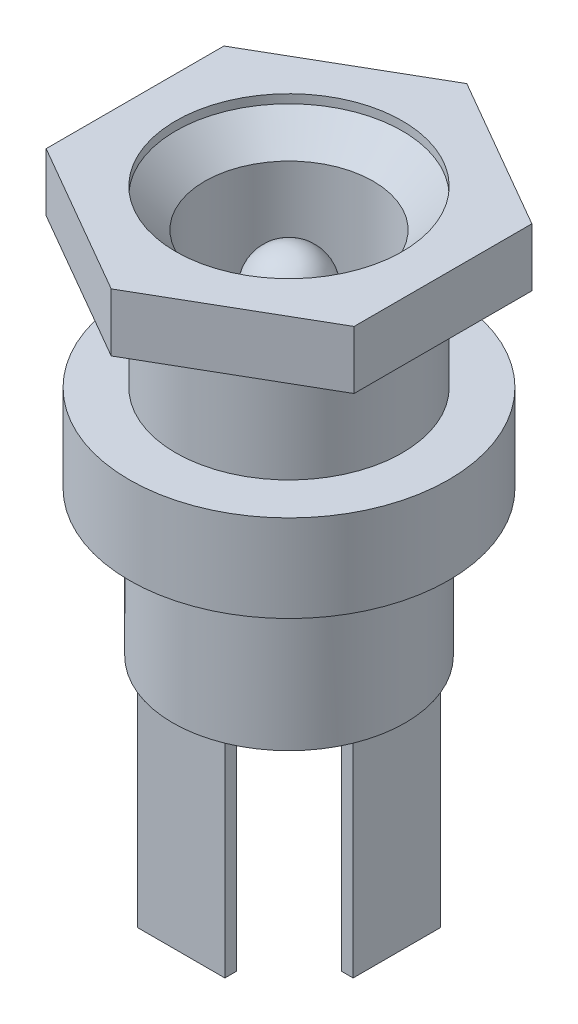
ISO-10303-21;
HEADER;
FILE_DESCRIPTION(('STEP AP214'),'2;1');
FILE_NAME('part.step','',(''),(''),'','','');
FILE_SCHEMA(('AUTOMOTIVE_DESIGN { 1 0 10303 214 1 1 1 1 }'));
ENDSEC;
DATA;
#1=APPLICATION_CONTEXT('core data for automotive mechanical design processes');
#2=APPLICATION_PROTOCOL_DEFINITION('international standard','automotive_design',2000,#1);
#3=PRODUCT_CONTEXT('',#1,'mechanical');
#4=PRODUCT('Part','Part','',(#3));
#5=PRODUCT_RELATED_PRODUCT_CATEGORY('part','',(#4));
#6=PRODUCT_DEFINITION_FORMATION('','',#4);
#7=PRODUCT_DEFINITION_CONTEXT('part definition',#1,'design');
#8=PRODUCT_DEFINITION('design','',#6,#7);
#9=PRODUCT_DEFINITION_SHAPE('','',#8);
#10=(LENGTH_UNIT() NAMED_UNIT(*) SI_UNIT(.MILLI.,.METRE.));
#11=(NAMED_UNIT(*) PLANE_ANGLE_UNIT() SI_UNIT($,.RADIAN.));
#12=(NAMED_UNIT(*) SI_UNIT($,.STERADIAN.) SOLID_ANGLE_UNIT());
#13=UNCERTAINTY_MEASURE_WITH_UNIT(LENGTH_MEASURE(1.E-05),#10,'distance_accuracy_value','');
#14=(GEOMETRIC_REPRESENTATION_CONTEXT(3) GLOBAL_UNCERTAINTY_ASSIGNED_CONTEXT((#13)) GLOBAL_UNIT_ASSIGNED_CONTEXT((#10,
#11,#12)) REPRESENTATION_CONTEXT('',''));
#15=CARTESIAN_POINT('',(0.,0.,0.));
#16=DIRECTION('',(0.,0.,1.));
#17=DIRECTION('',(1.,0.,0.));
#18=AXIS2_PLACEMENT_3D('',#15,#16,#17);
#19=CARTESIAN_POINT('',(0.,0.,4.));
#20=DIRECTION('',(0.,-1.,0.));
#21=DIRECTION('',(0.,0.,-1.));
#22=AXIS2_PLACEMENT_3D('',#19,#20,#21);
#23=PLANE('',#22);
#24=DIRECTION('',(-1.,0.,0.));
#25=VECTOR('',#24,1.);
#26=CARTESIAN_POINT('',(1.5,0.,-3.30809924354783));
#27=LINE('',#26,#25);
#28=CARTESIAN_POINT('',(1.5,0.,-3.30809924354783));
#29=VERTEX_POINT('',#28);
#30=CARTESIAN_POINT('',(-1.5,0.,-3.30809924354783));
#31=VERTEX_POINT('',#30);
#32=EDGE_CURVE('E482',#29,#31,#27,.T.);
#33=ORIENTED_EDGE('',*,*,#32,.F.);
#34=DIRECTION('',(0.,0.,1.));
#35=VECTOR('',#34,1.);
#36=CARTESIAN_POINT('',(1.5,0.,-3.70809924354783));
#37=LINE('',#36,#35);
#38=CARTESIAN_POINT('',(1.5,0.,-3.70809924354783));
#39=VERTEX_POINT('',#38);
#40=EDGE_CURVE('E193',#39,#29,#37,.T.);
#41=ORIENTED_EDGE('',*,*,#40,.F.);
#42=CARTESIAN_POINT('',(0.,0.,0.));
#43=DIRECTION('',(0.,1.,0.));
#44=DIRECTION('',(0.,0.,1.));
#45=AXIS2_PLACEMENT_3D('',#42,#43,#44);
#46=CIRCLE('',#45,4.);
#47=CARTESIAN_POINT('',(3.70809924354783,0.,-1.50000000000001));
#48=VERTEX_POINT('',#47);
#49=EDGE_CURVE('E448',#48,#39,#46,.T.);
#50=ORIENTED_EDGE('',*,*,#49,.F.);
#51=DIRECTION('',(1.,0.,0.));
#52=VECTOR('',#51,1.);
#53=CARTESIAN_POINT('',(3.70809924354783,0.,-1.50000000000001));
#54=LINE('',#53,#52);
#55=CARTESIAN_POINT('',(3.30809924354783,0.,-1.50000000000001));
#56=VERTEX_POINT('',#55);
#57=EDGE_CURVE('E223',#56,#48,#54,.T.);
#58=ORIENTED_EDGE('',*,*,#57,.F.);
#59=DIRECTION('',(0.,0.,-1.));
#60=VECTOR('',#59,1.);
#61=CARTESIAN_POINT('',(3.30809924354784,0.,1.49999999999999));
#62=LINE('',#61,#60);
#63=CARTESIAN_POINT('',(3.30809924354784,0.,1.49999999999999));
#64=VERTEX_POINT('',#63);
#65=EDGE_CURVE('E201',#64,#56,#62,.T.);
#66=ORIENTED_EDGE('',*,*,#65,.F.);
#67=DIRECTION('',(-1.,0.,0.));
#68=VECTOR('',#67,1.);
#69=CARTESIAN_POINT('',(3.70809924354784,0.,1.49999999999999));
#70=LINE('',#69,#68);
#71=CARTESIAN_POINT('',(3.70809924354784,0.,1.49999999999999));
#72=VERTEX_POINT('',#71);
#73=EDGE_CURVE('E196',#72,#64,#70,.T.);
#74=ORIENTED_EDGE('',*,*,#73,.F.);
#75=CARTESIAN_POINT('',(1.5,0.,3.70809924354783));
#76=VERTEX_POINT('',#75);
#77=EDGE_CURVE('E360',#76,#72,#46,.T.);
#78=ORIENTED_EDGE('',*,*,#77,.F.);
#79=DIRECTION('',(0.,0.,1.));
#80=VECTOR('',#79,1.);
#81=CARTESIAN_POINT('',(1.5,0.,3.70809924354783));
#82=LINE('',#81,#80);
#83=CARTESIAN_POINT('',(1.5,0.,3.30809924354783));
#84=VERTEX_POINT('',#83);
#85=EDGE_CURVE('E263',#84,#76,#82,.T.);
#86=ORIENTED_EDGE('',*,*,#85,.F.);
#87=DIRECTION('',(1.,0.,0.));
#88=VECTOR('',#87,1.);
#89=CARTESIAN_POINT('',(-1.5,0.,3.30809924354783));
#90=LINE('',#89,#88);
#91=CARTESIAN_POINT('',(-1.5,0.,3.30809924354783));
#92=VERTEX_POINT('',#91);
#93=EDGE_CURVE('E259',#92,#84,#90,.T.);
#94=ORIENTED_EDGE('',*,*,#93,.F.);
#95=DIRECTION('',(0.,0.,-1.));
#96=VECTOR('',#95,1.);
#97=CARTESIAN_POINT('',(-1.5,0.,3.70809924354783));
#98=LINE('',#97,#96);
#99=CARTESIAN_POINT('',(-1.5,0.,3.70809924354783));
#100=VERTEX_POINT('',#99);
#101=EDGE_CURVE('E240',#100,#92,#98,.T.);
#102=ORIENTED_EDGE('',*,*,#101,.F.);
#103=CARTESIAN_POINT('',(-1.5,0.,-3.70809924354783));
#104=VERTEX_POINT('',#103);
#105=EDGE_CURVE('E366',#104,#100,#46,.T.);
#106=ORIENTED_EDGE('',*,*,#105,.F.);
#107=DIRECTION('',(0.,0.,-1.));
#108=VECTOR('',#107,1.);
#109=CARTESIAN_POINT('',(-1.5,0.,-3.70809924354783));
#110=LINE('',#109,#108);
#111=EDGE_CURVE('E487',#31,#104,#110,.T.);
#112=ORIENTED_EDGE('',*,*,#111,.F.);
#113=EDGE_LOOP('',(#33,#41,#50,#58,#66,#74,#78,#86,#94,#102,#106,#112));
#114=FACE_BOUND('',#113,.T.);
#115=ADVANCED_FACE('F41',(#114),#23,.T.);
#116=EDGE_CURVE('E477',#39,#104,#46,.T.);
#117=ORIENTED_EDGE('',*,*,#116,.F.);
#118=DIRECTION('',(1.,0.,0.));
#119=VECTOR('',#118,1.);
#120=CARTESIAN_POINT('',(1.5,0.,-3.70809924354783));
#121=LINE('',#120,#119);
#122=EDGE_CURVE('E189',#104,#39,#121,.T.);
#123=ORIENTED_EDGE('',*,*,#122,.F.);
#124=EDGE_LOOP('',(#117,#123));
#125=FACE_BOUND('',#124,.T.);
#126=ADVANCED_FACE('F409',(#125),#23,.T.);
#127=EDGE_CURVE('E365',#72,#48,#46,.T.);
#128=ORIENTED_EDGE('',*,*,#127,.F.);
#129=DIRECTION('',(0.,0.,1.));
#130=VECTOR('',#129,1.);
#131=CARTESIAN_POINT('',(3.70809924354784,0.,1.49999999999999));
#132=LINE('',#131,#130);
#133=EDGE_CURVE('E211',#48,#72,#132,.T.);
#134=ORIENTED_EDGE('',*,*,#133,.F.);
#135=EDGE_LOOP('',(#128,#134));
#136=FACE_BOUND('',#135,.T.);
#137=ADVANCED_FACE('F416',(#136),#23,.T.);
#138=CARTESIAN_POINT('',(0.,12.2,0.));
#139=DIRECTION('',(0.,1.,0.));
#140=DIRECTION('',(0.,0.,1.));
#141=AXIS2_PLACEMENT_3D('',#138,#139,#140);
#142=CYLINDRICAL_SURFACE('',#141,3.9);
#143=CARTESIAN_POINT('',(0.,8.,0.));
#144=DIRECTION('',(0.,1.,0.));
#145=DIRECTION('',(0.,0.,1.));
#146=AXIS2_PLACEMENT_3D('',#143,#144,#145);
#147=CIRCLE('',#146,3.9);
#148=CARTESIAN_POINT('',(0.,8.,3.9));
#149=VERTEX_POINT('',#148);
#150=EDGE_CURVE('E378',#149,#149,#147,.T.);
#151=ORIENTED_EDGE('',*,*,#150,.T.);
#152=EDGE_LOOP('',(#151));
#153=FACE_BOUND('',#152,.T.);
#154=CARTESIAN_POINT('',(0.,12.,0.));
#155=DIRECTION('',(0.,1.,0.));
#156=DIRECTION('',(0.,0.,1.));
#157=AXIS2_PLACEMENT_3D('',#154,#155,#156);
#158=CIRCLE('',#157,3.9);
#159=CARTESIAN_POINT('',(0.,12.,3.9));
#160=VERTEX_POINT('',#159);
#161=EDGE_CURVE('E285',#160,#160,#158,.T.);
#162=ORIENTED_EDGE('',*,*,#161,.F.);
#163=EDGE_LOOP('',(#162));
#164=FACE_BOUND('',#163,.T.);
#165=ADVANCED_FACE('F434',(#153,#164),#142,.T.);
#166=CARTESIAN_POINT('',(0.,8.,3.9));
#167=DIRECTION('',(0.,1.,0.));
#168=DIRECTION('',(0.,0.,1.));
#169=AXIS2_PLACEMENT_3D('',#166,#167,#168);
#170=PLANE('',#169);
#171=CARTESIAN_POINT('',(0.,8.,0.));
#172=DIRECTION('',(0.,1.,0.));
#173=DIRECTION('',(0.,0.,1.));
#174=AXIS2_PLACEMENT_3D('',#171,#172,#173);
#175=CIRCLE('',#174,5.5);
#176=CARTESIAN_POINT('',(0.,8.,5.5));
#177=VERTEX_POINT('',#176);
#178=EDGE_CURVE('E374',#177,#177,#175,.T.);
#179=ORIENTED_EDGE('',*,*,#178,.T.);
#180=EDGE_LOOP('',(#179));
#181=FACE_BOUND('',#180,.T.);
#182=ORIENTED_EDGE('',*,*,#150,.F.);
#183=EDGE_LOOP('',(#182));
#184=FACE_BOUND('',#183,.T.);
#185=ADVANCED_FACE('F439',(#181,#184),#170,.T.);
#186=CARTESIAN_POINT('',(0.,12.2,0.));
#187=DIRECTION('',(0.,1.,0.));
#188=DIRECTION('',(0.,0.,1.));
#189=AXIS2_PLACEMENT_3D('',#186,#187,#188);
#190=CYLINDRICAL_SURFACE('',#189,5.5);
#191=CARTESIAN_POINT('',(0.,5.,0.));
#192=DIRECTION('',(0.,1.,0.));
#193=DIRECTION('',(0.,0.,1.));
#194=AXIS2_PLACEMENT_3D('',#191,#192,#193);
#195=CIRCLE('',#194,5.5);
#196=CARTESIAN_POINT('',(0.,5.,5.5));
#197=VERTEX_POINT('',#196);
#198=EDGE_CURVE('E370',#197,#197,#195,.T.);
#199=ORIENTED_EDGE('',*,*,#198,.T.);
#200=EDGE_LOOP('',(#199));
#201=FACE_BOUND('',#200,.T.);
#202=ORIENTED_EDGE('',*,*,#178,.F.);
#203=EDGE_LOOP('',(#202));
#204=FACE_BOUND('',#203,.T.);
#205=ADVANCED_FACE('F664',(#201,#204),#190,.T.);
#206=CARTESIAN_POINT('',(0.,5.,5.5));
#207=DIRECTION('',(0.,-1.,0.));
#208=DIRECTION('',(0.,0.,-1.));
#209=AXIS2_PLACEMENT_3D('',#206,#207,#208);
#210=PLANE('',#209);
#211=CARTESIAN_POINT('',(0.,5.,0.));
#212=DIRECTION('',(0.,1.,0.));
#213=DIRECTION('',(0.,0.,1.));
#214=AXIS2_PLACEMENT_3D('',#211,#212,#213);
#215=CIRCLE('',#214,4.);
#216=CARTESIAN_POINT('',(0.,5.,4.));
#217=VERTEX_POINT('',#216);
#218=EDGE_CURVE('E364',#217,#217,#215,.T.);
#219=ORIENTED_EDGE('',*,*,#218,.T.);
#220=EDGE_LOOP('',(#219));
#221=FACE_BOUND('',#220,.T.);
#222=ORIENTED_EDGE('',*,*,#198,.F.);
#223=EDGE_LOOP('',(#222));
#224=FACE_BOUND('',#223,.T.);
#225=ADVANCED_FACE('F431',(#221,#224),#210,.T.);
#226=CARTESIAN_POINT('',(0.,12.2,0.));
#227=DIRECTION('',(0.,1.,0.));
#228=DIRECTION('',(0.,0.,1.));
#229=AXIS2_PLACEMENT_3D('',#226,#227,#228);
#230=CYLINDRICAL_SURFACE('',#229,4.);
#231=ORIENTED_EDGE('',*,*,#77,.T.);
#232=ORIENTED_EDGE('',*,*,#127,.T.);
#233=ORIENTED_EDGE('',*,*,#49,.T.);
#234=ORIENTED_EDGE('',*,*,#116,.T.);
#235=ORIENTED_EDGE('',*,*,#105,.T.);
#236=EDGE_CURVE('E359',#100,#76,#46,.T.);
#237=ORIENTED_EDGE('',*,*,#236,.T.);
#238=EDGE_LOOP('',(#231,#232,#233,#234,#235,#237));
#239=FACE_BOUND('',#238,.T.);
#240=ORIENTED_EDGE('',*,*,#218,.F.);
#241=EDGE_LOOP('',(#240));
#242=FACE_BOUND('',#241,.T.);
#243=ADVANCED_FACE('F422',(#239,#242),#230,.T.);
#244=DIRECTION('',(-1.,0.,0.));
#245=VECTOR('',#244,1.);
#246=CARTESIAN_POINT('',(-1.5,0.,3.70809924354783));
#247=LINE('',#246,#245);
#248=EDGE_CURVE('E246',#76,#100,#247,.T.);
#249=ORIENTED_EDGE('',*,*,#248,.F.);
#250=ORIENTED_EDGE('',*,*,#236,.F.);
#251=EDGE_LOOP('',(#249,#250));
#252=FACE_BOUND('',#251,.T.);
#253=ADVANCED_FACE('F412',(#252),#23,.T.);
#254=CARTESIAN_POINT('',(0.,14.,0.));
#255=DIRECTION('',(0.,1.,0.));
#256=DIRECTION('',(0.,0.,1.));
#257=AXIS2_PLACEMENT_3D('',#254,#255,#256);
#258=PLANE('',#257);
#259=DIRECTION('',(0.,0.,-1.));
#260=VECTOR('',#259,1.);
#261=CARTESIAN_POINT('',(5.3,14.,3.05995642670502));
#262=LINE('',#261,#260);
#263=CARTESIAN_POINT('',(5.3,14.,3.05995642670502));
#264=VERTEX_POINT('',#263);
#265=CARTESIAN_POINT('',(5.3,14.,-3.05995642670502));
#266=VERTEX_POINT('',#265);
#267=EDGE_CURVE('E294',#264,#266,#262,.T.);
#268=ORIENTED_EDGE('',*,*,#267,.T.);
#269=DIRECTION('',(-0.866025403784439,0.,-0.5));
#270=VECTOR('',#269,1.);
#271=CARTESIAN_POINT('',(5.3,14.,-3.05995642670502));
#272=LINE('',#271,#270);
#273=CARTESIAN_POINT('',(0.,14.,-6.11991285341003));
#274=VERTEX_POINT('',#273);
#275=EDGE_CURVE('E298',#266,#274,#272,.T.);
#276=ORIENTED_EDGE('',*,*,#275,.T.);
#277=DIRECTION('',(-0.866025403784439,0.,0.5));
#278=VECTOR('',#277,1.);
#279=CARTESIAN_POINT('',(0.,14.,-6.11991285341003));
#280=LINE('',#279,#278);
#281=CARTESIAN_POINT('',(-5.3,14.,-3.05995642670502));
#282=VERTEX_POINT('',#281);
#283=EDGE_CURVE('E302',#274,#282,#280,.T.);
#284=ORIENTED_EDGE('',*,*,#283,.T.);
#285=DIRECTION('',(0.,0.,1.));
#286=VECTOR('',#285,1.);
#287=CARTESIAN_POINT('',(-5.3,14.,-3.05995642670502));
#288=LINE('',#287,#286);
#289=CARTESIAN_POINT('',(-5.3,14.,3.05995642670502));
#290=VERTEX_POINT('',#289);
#291=EDGE_CURVE('E305',#282,#290,#288,.T.);
#292=ORIENTED_EDGE('',*,*,#291,.T.);
#293=DIRECTION('',(0.866025403784439,0.,0.5));
#294=VECTOR('',#293,1.);
#295=CARTESIAN_POINT('',(-5.3,14.,3.05995642670502));
#296=LINE('',#295,#294);
#297=CARTESIAN_POINT('',(0.,14.,6.11991285341003));
#298=VERTEX_POINT('',#297);
#299=EDGE_CURVE('E308',#290,#298,#296,.T.);
#300=ORIENTED_EDGE('',*,*,#299,.T.);
#301=DIRECTION('',(0.866025403784439,0.,-0.5));
#302=VECTOR('',#301,1.);
#303=CARTESIAN_POINT('',(0.,14.,6.11991285341003));
#304=LINE('',#303,#302);
#305=EDGE_CURVE('E311',#298,#264,#304,.T.);
#306=ORIENTED_EDGE('',*,*,#305,.T.);
#307=EDGE_LOOP('',(#268,#276,#284,#292,#300,#306));
#308=FACE_BOUND('',#307,.T.);
#309=CARTESIAN_POINT('',(0.,14.,0.));
#310=DIRECTION('',(0.,1.,0.));
#311=DIRECTION('',(0.,0.,1.));
#312=AXIS2_PLACEMENT_3D('',#309,#310,#311);
#313=CIRCLE('',#312,3.9);
#314=CARTESIAN_POINT('',(0.,14.,3.9));
#315=VERTEX_POINT('',#314);
#316=EDGE_CURVE('E286',#315,#315,#313,.T.);
#317=ORIENTED_EDGE('',*,*,#316,.F.);
#318=EDGE_LOOP('',(#317));
#319=FACE_BOUND('',#318,.T.);
#320=ADVANCED_FACE('F421',(#308,#319),#258,.T.);
#321=CARTESIAN_POINT('',(0.,12.,0.));
#322=DIRECTION('',(0.,1.,0.));
#323=DIRECTION('',(0.,0.,1.));
#324=AXIS2_PLACEMENT_3D('',#321,#322,#323);
#325=PLANE('',#324);
#326=DIRECTION('',(0.,0.,-1.));
#327=VECTOR('',#326,1.);
#328=CARTESIAN_POINT('',(5.3,12.,3.05995642670502));
#329=LINE('',#328,#327);
#330=CARTESIAN_POINT('',(5.3,12.,3.05995642670502));
#331=VERTEX_POINT('',#330);
#332=CARTESIAN_POINT('',(5.3,12.,-3.05995642670502));
#333=VERTEX_POINT('',#332);
#334=EDGE_CURVE('E290',#331,#333,#329,.T.);
#335=ORIENTED_EDGE('',*,*,#334,.F.);
#336=DIRECTION('',(0.866025403784439,0.,-0.5));
#337=VECTOR('',#336,1.);
#338=CARTESIAN_POINT('',(0.,12.,6.11991285341003));
#339=LINE('',#338,#337);
#340=CARTESIAN_POINT('',(0.,12.,6.11991285341003));
#341=VERTEX_POINT('',#340);
#342=EDGE_CURVE('E299',#341,#331,#339,.T.);
#343=ORIENTED_EDGE('',*,*,#342,.F.);
#344=DIRECTION('',(0.866025403784439,0.,0.5));
#345=VECTOR('',#344,1.);
#346=CARTESIAN_POINT('',(-5.3,12.,3.05995642670502));
#347=LINE('',#346,#345);
#348=CARTESIAN_POINT('',(-5.3,12.,3.05995642670502));
#349=VERTEX_POINT('',#348);
#350=EDGE_CURVE('E327',#349,#341,#347,.T.);
#351=ORIENTED_EDGE('',*,*,#350,.F.);
#352=DIRECTION('',(0.,0.,1.));
#353=VECTOR('',#352,1.);
#354=CARTESIAN_POINT('',(-5.3,12.,-3.05995642670502));
#355=LINE('',#354,#353);
#356=CARTESIAN_POINT('',(-5.3,12.,-3.05995642670502));
#357=VERTEX_POINT('',#356);
#358=EDGE_CURVE('E324',#357,#349,#355,.T.);
#359=ORIENTED_EDGE('',*,*,#358,.F.);
#360=DIRECTION('',(-0.866025403784439,0.,0.5));
#361=VECTOR('',#360,1.);
#362=CARTESIAN_POINT('',(0.,12.,-6.11991285341003));
#363=LINE('',#362,#361);
#364=CARTESIAN_POINT('',(0.,12.,-6.11991285341003));
#365=VERTEX_POINT('',#364);
#366=EDGE_CURVE('E321',#365,#357,#363,.T.);
#367=ORIENTED_EDGE('',*,*,#366,.F.);
#368=DIRECTION('',(-0.866025403784439,0.,-0.5));
#369=VECTOR('',#368,1.);
#370=CARTESIAN_POINT('',(5.3,12.,-3.05995642670502));
#371=LINE('',#370,#369);
#372=EDGE_CURVE('E318',#333,#365,#371,.T.);
#373=ORIENTED_EDGE('',*,*,#372,.F.);
#374=EDGE_LOOP('',(#335,#343,#351,#359,#367,#373));
#375=FACE_BOUND('',#374,.T.);
#376=ORIENTED_EDGE('',*,*,#161,.T.);
#377=EDGE_LOOP('',(#376));
#378=FACE_BOUND('',#377,.T.);
#379=ADVANCED_FACE('F428',(#375,#378),#325,.F.);
#380=CARTESIAN_POINT('',(5.3,14.,3.05995642670502));
#381=DIRECTION('',(-1.,0.,0.));
#382=DIRECTION('',(0.,0.,1.));
#383=AXIS2_PLACEMENT_3D('',#380,#381,#382);
#384=PLANE('',#383);
#385=ORIENTED_EDGE('',*,*,#334,.T.);
#386=DIRECTION('',(0.,-1.,0.));
#387=VECTOR('',#386,1.);
#388=CARTESIAN_POINT('',(5.3,14.,-3.05995642670502));
#389=LINE('',#388,#387);
#390=EDGE_CURVE('E351',#266,#333,#389,.T.);
#391=ORIENTED_EDGE('',*,*,#390,.F.);
#392=ORIENTED_EDGE('',*,*,#267,.F.);
#393=DIRECTION('',(0.,-1.,0.));
#394=VECTOR('',#393,1.);
#395=CARTESIAN_POINT('',(5.3,14.,3.05995642670502));
#396=LINE('',#395,#394);
#397=EDGE_CURVE('E314',#264,#331,#396,.T.);
#398=ORIENTED_EDGE('',*,*,#397,.T.);
#399=EDGE_LOOP('',(#385,#391,#392,#398));
#400=FACE_BOUND('',#399,.T.);
#401=ADVANCED_FACE('F554',(#400),#384,.F.);
#402=CARTESIAN_POINT('',(5.3,14.,-3.05995642670502));
#403=DIRECTION('',(-0.5,0.,0.866025403784439));
#404=DIRECTION('',(0.866025403784439,0.,0.5));
#405=AXIS2_PLACEMENT_3D('',#402,#403,#404);
#406=PLANE('',#405);
#407=ORIENTED_EDGE('',*,*,#372,.T.);
#408=DIRECTION('',(0.,-1.,0.));
#409=VECTOR('',#408,1.);
#410=CARTESIAN_POINT('',(0.,14.,-6.11991285341003));
#411=LINE('',#410,#409);
#412=EDGE_CURVE('E347',#274,#365,#411,.T.);
#413=ORIENTED_EDGE('',*,*,#412,.F.);
#414=ORIENTED_EDGE('',*,*,#275,.F.);
#415=ORIENTED_EDGE('',*,*,#390,.T.);
#416=EDGE_LOOP('',(#407,#413,#414,#415));
#417=FACE_BOUND('',#416,.T.);
#418=ADVANCED_FACE('F570',(#417),#406,.F.);
#419=CARTESIAN_POINT('',(0.,14.,-6.11991285341003));
#420=DIRECTION('',(0.5,0.,0.866025403784439));
#421=DIRECTION('',(0.866025403784439,0.,-0.5));
#422=AXIS2_PLACEMENT_3D('',#419,#420,#421);
#423=PLANE('',#422);
#424=ORIENTED_EDGE('',*,*,#366,.T.);
#425=DIRECTION('',(0.,-1.,0.));
#426=VECTOR('',#425,1.);
#427=CARTESIAN_POINT('',(-5.3,14.,-3.05995642670502));
#428=LINE('',#427,#426);
#429=EDGE_CURVE('E343',#282,#357,#428,.T.);
#430=ORIENTED_EDGE('',*,*,#429,.F.);
#431=ORIENTED_EDGE('',*,*,#283,.F.);
#432=ORIENTED_EDGE('',*,*,#412,.T.);
#433=EDGE_LOOP('',(#424,#430,#431,#432));
#434=FACE_BOUND('',#433,.T.);
#435=ADVANCED_FACE('F566',(#434),#423,.F.);
#436=CARTESIAN_POINT('',(-5.3,14.,-3.05995642670502));
#437=DIRECTION('',(1.,0.,0.));
#438=DIRECTION('',(0.,0.,-1.));
#439=AXIS2_PLACEMENT_3D('',#436,#437,#438);
#440=PLANE('',#439);
#441=ORIENTED_EDGE('',*,*,#358,.T.);
#442=DIRECTION('',(0.,-1.,0.));
#443=VECTOR('',#442,1.);
#444=CARTESIAN_POINT('',(-5.3,14.,3.05995642670502));
#445=LINE('',#444,#443);
#446=EDGE_CURVE('E339',#290,#349,#445,.T.);
#447=ORIENTED_EDGE('',*,*,#446,.F.);
#448=ORIENTED_EDGE('',*,*,#291,.F.);
#449=ORIENTED_EDGE('',*,*,#429,.T.);
#450=EDGE_LOOP('',(#441,#447,#448,#449));
#451=FACE_BOUND('',#450,.T.);
#452=ADVANCED_FACE('F562',(#451),#440,.F.);
#453=CARTESIAN_POINT('',(-5.3,14.,3.05995642670502));
#454=DIRECTION('',(0.5,0.,-0.866025403784439));
#455=DIRECTION('',(-0.866025403784439,0.,-0.5));
#456=AXIS2_PLACEMENT_3D('',#453,#454,#455);
#457=PLANE('',#456);
#458=ORIENTED_EDGE('',*,*,#350,.T.);
#459=DIRECTION('',(0.,-1.,0.));
#460=VECTOR('',#459,1.);
#461=CARTESIAN_POINT('',(0.,14.,6.11991285341003));
#462=LINE('',#461,#460);
#463=EDGE_CURVE('E335',#298,#341,#462,.T.);
#464=ORIENTED_EDGE('',*,*,#463,.F.);
#465=ORIENTED_EDGE('',*,*,#299,.F.);
#466=ORIENTED_EDGE('',*,*,#446,.T.);
#467=EDGE_LOOP('',(#458,#464,#465,#466));
#468=FACE_BOUND('',#467,.T.);
#469=ADVANCED_FACE('F558',(#468),#457,.F.);
#470=CARTESIAN_POINT('',(0.,14.,6.11991285341003));
#471=DIRECTION('',(-0.5,0.,-0.866025403784439));
#472=DIRECTION('',(-0.866025403784439,0.,0.5));
#473=AXIS2_PLACEMENT_3D('',#470,#471,#472);
#474=PLANE('',#473);
#475=ORIENTED_EDGE('',*,*,#342,.T.);
#476=ORIENTED_EDGE('',*,*,#397,.F.);
#477=ORIENTED_EDGE('',*,*,#305,.F.);
#478=ORIENTED_EDGE('',*,*,#463,.T.);
#479=EDGE_LOOP('',(#475,#476,#477,#478));
#480=FACE_BOUND('',#479,.T.);
#481=ADVANCED_FACE('F549',(#480),#474,.F.);
#482=CARTESIAN_POINT('',(0.,14.,0.));
#483=DIRECTION('',(0.,-1.,0.));
#484=DIRECTION('',(0.,0.,-1.));
#485=AXIS2_PLACEMENT_3D('',#482,#483,#484);
#486=CYLINDRICAL_SURFACE('',#485,3.9);
#487=CARTESIAN_POINT('',(0.,13.7,0.));
#488=DIRECTION('',(0.,1.,0.));
#489=DIRECTION('',(0.,0.,1.));
#490=AXIS2_PLACEMENT_3D('',#487,#488,#489);
#491=CIRCLE('',#490,3.9);
#492=CARTESIAN_POINT('',(0.,13.7,3.9));
#493=VERTEX_POINT('',#492);
#494=EDGE_CURVE('E355',#493,#493,#491,.F.);
#495=ORIENTED_EDGE('',*,*,#494,.T.);
#496=EDGE_LOOP('',(#495));
#497=FACE_BOUND('',#496,.T.);
#498=ORIENTED_EDGE('',*,*,#316,.T.);
#499=EDGE_LOOP('',(#498));
#500=FACE_BOUND('',#499,.T.);
#501=ADVANCED_FACE('F547',(#497,#500),#486,.F.);
#502=CARTESIAN_POINT('',(0.,10.95,0.));
#503=DIRECTION('',(0.,1.,0.));
#504=DIRECTION('',(0.,0.,1.));
#505=AXIS2_PLACEMENT_3D('',#502,#503,#504);
#506=SPHERICAL_SURFACE('',#505,1.25);
#507=CARTESIAN_POINT('',(0.,10.95,0.));
#508=DIRECTION('',(0.,1.,0.));
#509=DIRECTION('',(0.,0.,1.));
#510=AXIS2_PLACEMENT_3D('',#507,#508,#509);
#511=CIRCLE('',#510,1.25);
#512=CARTESIAN_POINT('',(0.,10.95,1.25));
#513=VERTEX_POINT('',#512);
#514=EDGE_CURVE('E11',#513,#513,#511,.T.);
#515=ORIENTED_EDGE('',*,*,#514,.T.);
#516=EDGE_LOOP('',(#515));
#517=FACE_BOUND('',#516,.T.);
#518=ADVANCED_FACE('F43',(#517),#506,.T.);
#519=CARTESIAN_POINT('',(0.,12.2,0.));
#520=DIRECTION('',(0.,1.,0.));
#521=DIRECTION('',(0.,0.,1.));
#522=AXIS2_PLACEMENT_3D('',#519,#520,#521);
#523=CYLINDRICAL_SURFACE('',#522,1.25);
#524=CARTESIAN_POINT('',(0.,6.70000000000001,0.));
#525=DIRECTION('',(0.,1.,0.));
#526=DIRECTION('',(0.,0.,1.));
#527=AXIS2_PLACEMENT_3D('',#524,#525,#526);
#528=CIRCLE('',#527,1.25);
#529=CARTESIAN_POINT('',(0.,6.70000000000001,1.25));
#530=VERTEX_POINT('',#529);
#531=EDGE_CURVE('E50',#530,#530,#528,.T.);
#532=ORIENTED_EDGE('',*,*,#531,.T.);
#533=EDGE_LOOP('',(#532));
#534=FACE_BOUND('',#533,.T.);
#535=ORIENTED_EDGE('',*,*,#514,.F.);
#536=EDGE_LOOP('',(#535));
#537=FACE_BOUND('',#536,.T.);
#538=ADVANCED_FACE('F393',(#534,#537),#523,.T.);
#539=CARTESIAN_POINT('',(0.,6.7,2.9));
#540=DIRECTION('',(0.,1.,0.));
#541=DIRECTION('',(0.,0.,1.));
#542=AXIS2_PLACEMENT_3D('',#539,#540,#541);
#543=PLANE('',#542);
#544=CARTESIAN_POINT('',(0.,6.7,0.));
#545=DIRECTION('',(0.,1.,0.));
#546=DIRECTION('',(0.,0.,1.));
#547=AXIS2_PLACEMENT_3D('',#544,#545,#546);
#548=CIRCLE('',#547,2.9);
#549=CARTESIAN_POINT('',(0.,6.7,2.9));
#550=VERTEX_POINT('',#549);
#551=EDGE_CURVE('E386',#550,#550,#548,.T.);
#552=ORIENTED_EDGE('',*,*,#551,.T.);
#553=EDGE_LOOP('',(#552));
#554=FACE_BOUND('',#553,.T.);
#555=ORIENTED_EDGE('',*,*,#531,.F.);
#556=EDGE_LOOP('',(#555));
#557=FACE_BOUND('',#556,.T.);
#558=ADVANCED_FACE('F396',(#554,#557),#543,.T.);
#559=CARTESIAN_POINT('',(0.,12.2,0.));
#560=DIRECTION('',(0.,1.,0.));
#561=DIRECTION('',(0.,0.,1.));
#562=AXIS2_PLACEMENT_3D('',#559,#560,#561);
#563=CYLINDRICAL_SURFACE('',#562,2.9);
#564=CARTESIAN_POINT('',(0.,12.7,0.));
#565=DIRECTION('',(0.,1.,0.));
#566=DIRECTION('',(0.,0.,1.));
#567=AXIS2_PLACEMENT_3D('',#564,#565,#566);
#568=CIRCLE('',#567,2.9);
#569=CARTESIAN_POINT('',(0.,12.7,2.9));
#570=VERTEX_POINT('',#569);
#571=EDGE_CURVE('E382',#570,#570,#568,.T.);
#572=ORIENTED_EDGE('',*,*,#571,.T.);
#573=EDGE_LOOP('',(#572));
#574=FACE_BOUND('',#573,.T.);
#575=ORIENTED_EDGE('',*,*,#551,.F.);
#576=EDGE_LOOP('',(#575));
#577=FACE_BOUND('',#576,.T.);
#578=ADVANCED_FACE('F398',(#574,#577),#563,.F.);
#579=CARTESIAN_POINT('',(0.,12.7,0.));
#580=DIRECTION('',(0.,1.,0.));
#581=DIRECTION('',(0.,0.,1.));
#582=AXIS2_PLACEMENT_3D('',#579,#580,#581);
#583=CONICAL_SURFACE('',#582,2.9,0.785398163397451);
#584=ORIENTED_EDGE('',*,*,#494,.F.);
#585=EDGE_LOOP('',(#584));
#586=FACE_BOUND('',#585,.T.);
#587=ORIENTED_EDGE('',*,*,#571,.F.);
#588=EDGE_LOOP('',(#587));
#589=FACE_BOUND('',#588,.T.);
#590=ADVANCED_FACE('F405',(#586,#589),#583,.F.);
#591=CARTESIAN_POINT('',(-1.5,-7.,3.70809924354783));
#592=DIRECTION('',(1.,0.,0.));
#593=DIRECTION('',(0.,0.,-1.));
#594=AXIS2_PLACEMENT_3D('',#591,#592,#593);
#595=PLANE('',#594);
#596=ORIENTED_EDGE('',*,*,#101,.T.);
#597=DIRECTION('',(0.,1.,0.));
#598=VECTOR('',#597,1.);
#599=CARTESIAN_POINT('',(-1.5,-7.,3.30809924354783));
#600=LINE('',#599,#598);
#601=CARTESIAN_POINT('',(-1.5,-7.,3.30809924354783));
#602=VERTEX_POINT('',#601);
#603=EDGE_CURVE('E281',#602,#92,#600,.T.);
#604=ORIENTED_EDGE('',*,*,#603,.F.);
#605=DIRECTION('',(0.,0.,-1.));
#606=VECTOR('',#605,1.);
#607=CARTESIAN_POINT('',(-1.5,-7.,3.70809924354783));
#608=LINE('',#607,#606);
#609=CARTESIAN_POINT('',(-1.5,-7.,3.70809924354783));
#610=VERTEX_POINT('',#609);
#611=EDGE_CURVE('E241',#610,#602,#608,.T.);
#612=ORIENTED_EDGE('',*,*,#611,.F.);
#613=DIRECTION('',(0.,1.,0.));
#614=VECTOR('',#613,1.);
#615=CARTESIAN_POINT('',(-1.5,-7.,3.70809924354783));
#616=LINE('',#615,#614);
#617=EDGE_CURVE('E255',#610,#100,#616,.T.);
#618=ORIENTED_EDGE('',*,*,#617,.T.);
#619=EDGE_LOOP('',(#596,#604,#612,#618));
#620=FACE_BOUND('',#619,.T.);
#621=ADVANCED_FACE('F544',(#620),#595,.F.);
#622=CARTESIAN_POINT('',(-1.5,-7.,3.30809924354783));
#623=DIRECTION('',(0.,0.,1.));
#624=DIRECTION('',(1.,0.,0.));
#625=AXIS2_PLACEMENT_3D('',#622,#623,#624);
#626=PLANE('',#625);
#627=ORIENTED_EDGE('',*,*,#93,.T.);
#628=DIRECTION('',(0.,1.,0.));
#629=VECTOR('',#628,1.);
#630=CARTESIAN_POINT('',(1.5,-7.,3.30809924354783));
#631=LINE('',#630,#629);
#632=CARTESIAN_POINT('',(1.5,-7.,3.30809924354783));
#633=VERTEX_POINT('',#632);
#634=EDGE_CURVE('E277',#633,#84,#631,.T.);
#635=ORIENTED_EDGE('',*,*,#634,.F.);
#636=DIRECTION('',(1.,0.,0.));
#637=VECTOR('',#636,1.);
#638=CARTESIAN_POINT('',(-1.5,-7.,3.30809924354783));
#639=LINE('',#638,#637);
#640=EDGE_CURVE('E245',#602,#633,#639,.T.);
#641=ORIENTED_EDGE('',*,*,#640,.F.);
#642=ORIENTED_EDGE('',*,*,#603,.T.);
#643=EDGE_LOOP('',(#627,#635,#641,#642));
#644=FACE_BOUND('',#643,.T.);
#645=ADVANCED_FACE('F469',(#644),#626,.F.);
#646=CARTESIAN_POINT('',(1.5,-7.,3.70809924354783));
#647=DIRECTION('',(-1.,0.,0.));
#648=DIRECTION('',(0.,0.,1.));
#649=AXIS2_PLACEMENT_3D('',#646,#647,#648);
#650=PLANE('',#649);
#651=ORIENTED_EDGE('',*,*,#85,.T.);
#652=DIRECTION('',(0.,1.,0.));
#653=VECTOR('',#652,1.);
#654=CARTESIAN_POINT('',(1.5,-7.,3.70809924354783));
#655=LINE('',#654,#653);
#656=CARTESIAN_POINT('',(1.5,-7.,3.70809924354783));
#657=VERTEX_POINT('',#656);
#658=EDGE_CURVE('E273',#657,#76,#655,.T.);
#659=ORIENTED_EDGE('',*,*,#658,.F.);
#660=DIRECTION('',(0.,0.,1.));
#661=VECTOR('',#660,1.);
#662=CARTESIAN_POINT('',(1.5,-7.,3.70809924354783));
#663=LINE('',#662,#661);
#664=EDGE_CURVE('E249',#633,#657,#663,.T.);
#665=ORIENTED_EDGE('',*,*,#664,.F.);
#666=ORIENTED_EDGE('',*,*,#634,.T.);
#667=EDGE_LOOP('',(#651,#659,#665,#666));
#668=FACE_BOUND('',#667,.T.);
#669=ADVANCED_FACE('F457',(#668),#650,.F.);
#670=CARTESIAN_POINT('',(-1.5,-7.,3.70809924354783));
#671=DIRECTION('',(0.,0.,-1.));
#672=DIRECTION('',(-1.,0.,0.));
#673=AXIS2_PLACEMENT_3D('',#670,#671,#672);
#674=PLANE('',#673);
#675=ORIENTED_EDGE('',*,*,#248,.T.);
#676=ORIENTED_EDGE('',*,*,#617,.F.);
#677=DIRECTION('',(-1.,0.,0.));
#678=VECTOR('',#677,1.);
#679=CARTESIAN_POINT('',(-1.5,-7.,3.70809924354783));
#680=LINE('',#679,#678);
#681=EDGE_CURVE('E252',#657,#610,#680,.T.);
#682=ORIENTED_EDGE('',*,*,#681,.F.);
#683=ORIENTED_EDGE('',*,*,#658,.T.);
#684=EDGE_LOOP('',(#675,#676,#682,#683));
#685=FACE_BOUND('',#684,.T.);
#686=ADVANCED_FACE('F462',(#685),#674,.F.);
#687=CARTESIAN_POINT('',(0.,-7.,0.));
#688=DIRECTION('',(0.,-1.,0.));
#689=DIRECTION('',(0.,0.,-1.));
#690=AXIS2_PLACEMENT_3D('',#687,#688,#689);
#691=PLANE('',#690);
#692=ORIENTED_EDGE('',*,*,#611,.T.);
#693=ORIENTED_EDGE('',*,*,#640,.T.);
#694=ORIENTED_EDGE('',*,*,#664,.T.);
#695=ORIENTED_EDGE('',*,*,#681,.T.);
#696=EDGE_LOOP('',(#692,#693,#694,#695));
#697=FACE_BOUND('',#696,.T.);
#698=ADVANCED_FACE('F466',(#697),#691,.T.);
#699=CARTESIAN_POINT('',(3.70809924354784,-7.,1.49999999999999));
#700=DIRECTION('',(0.,0.,-1.));
#701=DIRECTION('',(-1.,0.,0.));
#702=AXIS2_PLACEMENT_3D('',#699,#700,#701);
#703=PLANE('',#702);
#704=ORIENTED_EDGE('',*,*,#73,.T.);
#705=DIRECTION('',(0.,1.,0.));
#706=VECTOR('',#705,1.);
#707=CARTESIAN_POINT('',(3.30809924354784,-7.,1.49999999999999));
#708=LINE('',#707,#706);
#709=CARTESIAN_POINT('',(3.30809924354784,-7.,1.49999999999999));
#710=VERTEX_POINT('',#709);
#711=EDGE_CURVE('E237',#710,#64,#708,.T.);
#712=ORIENTED_EDGE('',*,*,#711,.F.);
#713=DIRECTION('',(-1.,0.,0.));
#714=VECTOR('',#713,1.);
#715=CARTESIAN_POINT('',(3.70809924354784,-7.,1.49999999999999));
#716=LINE('',#715,#714);
#717=CARTESIAN_POINT('',(3.70809924354784,-7.,1.49999999999999));
#718=VERTEX_POINT('',#717);
#719=EDGE_CURVE('E206',#718,#710,#716,.T.);
#720=ORIENTED_EDGE('',*,*,#719,.F.);
#721=DIRECTION('',(0.,1.,0.));
#722=VECTOR('',#721,1.);
#723=CARTESIAN_POINT('',(3.70809924354784,-7.,1.49999999999999));
#724=LINE('',#723,#722);
#725=EDGE_CURVE('E219',#718,#72,#724,.T.);
#726=ORIENTED_EDGE('',*,*,#725,.T.);
#727=EDGE_LOOP('',(#704,#712,#720,#726));
#728=FACE_BOUND('',#727,.T.);
#729=ADVANCED_FACE('F531',(#728),#703,.F.);
#730=CARTESIAN_POINT('',(3.30809924354784,-7.,1.49999999999999));
#731=DIRECTION('',(1.,0.,0.));
#732=DIRECTION('',(0.,0.,-1.));
#733=AXIS2_PLACEMENT_3D('',#730,#731,#732);
#734=PLANE('',#733);
#735=ORIENTED_EDGE('',*,*,#65,.T.);
#736=DIRECTION('',(0.,1.,0.));
#737=VECTOR('',#736,1.);
#738=CARTESIAN_POINT('',(3.30809924354783,-7.,-1.50000000000001));
#739=LINE('',#738,#737);
#740=CARTESIAN_POINT('',(3.30809924354783,-7.,-1.50000000000001));
#741=VERTEX_POINT('',#740);
#742=EDGE_CURVE('E233',#741,#56,#739,.T.);
#743=ORIENTED_EDGE('',*,*,#742,.F.);
#744=DIRECTION('',(0.,0.,-1.));
#745=VECTOR('',#744,1.);
#746=CARTESIAN_POINT('',(3.30809924354784,-7.,1.49999999999999));
#747=LINE('',#746,#745);
#748=EDGE_CURVE('E210',#710,#741,#747,.T.);
#749=ORIENTED_EDGE('',*,*,#748,.F.);
#750=ORIENTED_EDGE('',*,*,#711,.T.);
#751=EDGE_LOOP('',(#735,#743,#749,#750));
#752=FACE_BOUND('',#751,.T.);
#753=ADVANCED_FACE('F527',(#752),#734,.F.);
#754=CARTESIAN_POINT('',(3.70809924354783,-7.,-1.50000000000001));
#755=DIRECTION('',(0.,0.,1.));
#756=DIRECTION('',(1.,0.,0.));
#757=AXIS2_PLACEMENT_3D('',#754,#755,#756);
#758=PLANE('',#757);
#759=ORIENTED_EDGE('',*,*,#57,.T.);
#760=DIRECTION('',(0.,1.,0.));
#761=VECTOR('',#760,1.);
#762=CARTESIAN_POINT('',(3.70809924354783,-7.,-1.50000000000001));
#763=LINE('',#762,#761);
#764=CARTESIAN_POINT('',(3.70809924354783,-7.,-1.50000000000001));
#765=VERTEX_POINT('',#764);
#766=EDGE_CURVE('E65',#765,#48,#763,.T.);
#767=ORIENTED_EDGE('',*,*,#766,.F.);
#768=DIRECTION('',(1.,0.,0.));
#769=VECTOR('',#768,1.);
#770=CARTESIAN_POINT('',(3.70809924354783,-7.,-1.50000000000001));
#771=LINE('',#770,#769);
#772=EDGE_CURVE('E214',#741,#765,#771,.T.);
#773=ORIENTED_EDGE('',*,*,#772,.F.);
#774=ORIENTED_EDGE('',*,*,#742,.T.);
#775=EDGE_LOOP('',(#759,#767,#773,#774));
#776=FACE_BOUND('',#775,.T.);
#777=ADVANCED_FACE('F524',(#776),#758,.F.);
#778=CARTESIAN_POINT('',(3.70809924354784,-7.,1.49999999999999));
#779=DIRECTION('',(-1.,0.,0.));
#780=DIRECTION('',(0.,0.,1.));
#781=AXIS2_PLACEMENT_3D('',#778,#779,#780);
#782=PLANE('',#781);
#783=ORIENTED_EDGE('',*,*,#133,.T.);
#784=ORIENTED_EDGE('',*,*,#725,.F.);
#785=DIRECTION('',(0.,0.,1.));
#786=VECTOR('',#785,1.);
#787=CARTESIAN_POINT('',(3.70809924354784,-7.,1.49999999999999));
#788=LINE('',#787,#786);
#789=EDGE_CURVE('E217',#765,#718,#788,.T.);
#790=ORIENTED_EDGE('',*,*,#789,.F.);
#791=ORIENTED_EDGE('',*,*,#766,.T.);
#792=EDGE_LOOP('',(#783,#784,#790,#791));
#793=FACE_BOUND('',#792,.T.);
#794=ADVANCED_FACE('F520',(#793),#782,.F.);
#795=CARTESIAN_POINT('',(0.,-7.,0.));
#796=DIRECTION('',(0.,-1.,0.));
#797=DIRECTION('',(-1.,0.,0.));
#798=AXIS2_PLACEMENT_3D('',#795,#796,#797);
#799=PLANE('',#798);
#800=ORIENTED_EDGE('',*,*,#719,.T.);
#801=ORIENTED_EDGE('',*,*,#748,.T.);
#802=ORIENTED_EDGE('',*,*,#772,.T.);
#803=ORIENTED_EDGE('',*,*,#789,.T.);
#804=EDGE_LOOP('',(#800,#801,#802,#803));
#805=FACE_BOUND('',#804,.T.);
#806=ADVANCED_FACE('F517',(#805),#799,.T.);
#807=CARTESIAN_POINT('',(1.5,-7.,-3.70809924354783));
#808=DIRECTION('',(-1.,0.,0.));
#809=DIRECTION('',(0.,0.,1.));
#810=AXIS2_PLACEMENT_3D('',#807,#808,#809);
#811=PLANE('',#810);
#812=ORIENTED_EDGE('',*,*,#40,.T.);
#813=DIRECTION('',(0.,1.,0.));
#814=VECTOR('',#813,1.);
#815=CARTESIAN_POINT('',(1.5,-7.,-3.30809924354783));
#816=LINE('',#815,#814);
#817=CARTESIAN_POINT('',(1.5,-7.,-3.30809924354783));
#818=VERTEX_POINT('',#817);
#819=EDGE_CURVE('E172',#818,#29,#816,.T.);
#820=ORIENTED_EDGE('',*,*,#819,.F.);
#821=DIRECTION('',(0.,0.,1.));
#822=VECTOR('',#821,1.);
#823=CARTESIAN_POINT('',(1.5,-7.,-3.70809924354783));
#824=LINE('',#823,#822);
#825=CARTESIAN_POINT('',(1.5,-7.,-3.70809924354783));
#826=VERTEX_POINT('',#825);
#827=EDGE_CURVE('E180',#826,#818,#824,.T.);
#828=ORIENTED_EDGE('',*,*,#827,.F.);
#829=DIRECTION('',(0.,1.,0.));
#830=VECTOR('',#829,1.);
#831=CARTESIAN_POINT('',(1.5,-7.,-3.70809924354783));
#832=LINE('',#831,#830);
#833=EDGE_CURVE('E493',#826,#39,#832,.T.);
#834=ORIENTED_EDGE('',*,*,#833,.T.);
#835=EDGE_LOOP('',(#812,#820,#828,#834));
#836=FACE_BOUND('',#835,.T.);
#837=ADVANCED_FACE('F191',(#836),#811,.F.);
#838=CARTESIAN_POINT('',(1.5,-7.,-3.30809924354783));
#839=DIRECTION('',(0.,0.,-1.));
#840=DIRECTION('',(-1.,0.,0.));
#841=AXIS2_PLACEMENT_3D('',#838,#839,#840);
#842=PLANE('',#841);
#843=ORIENTED_EDGE('',*,*,#32,.T.);
#844=DIRECTION('',(0.,1.,0.));
#845=VECTOR('',#844,1.);
#846=CARTESIAN_POINT('',(-1.5,-7.,-3.30809924354783));
#847=LINE('',#846,#845);
#848=CARTESIAN_POINT('',(-1.5,-7.,-3.30809924354783));
#849=VERTEX_POINT('',#848);
#850=EDGE_CURVE('E175',#849,#31,#847,.T.);
#851=ORIENTED_EDGE('',*,*,#850,.F.);
#852=DIRECTION('',(-1.,0.,0.));
#853=VECTOR('',#852,1.);
#854=CARTESIAN_POINT('',(1.5,-7.,-3.30809924354783));
#855=LINE('',#854,#853);
#856=EDGE_CURVE('E168',#818,#849,#855,.T.);
#857=ORIENTED_EDGE('',*,*,#856,.F.);
#858=ORIENTED_EDGE('',*,*,#819,.T.);
#859=EDGE_LOOP('',(#843,#851,#857,#858));
#860=FACE_BOUND('',#859,.T.);
#861=ADVANCED_FACE('F170',(#860),#842,.F.);
#862=CARTESIAN_POINT('',(-1.5,-7.,-3.70809924354783));
#863=DIRECTION('',(1.,0.,0.));
#864=DIRECTION('',(0.,0.,-1.));
#865=AXIS2_PLACEMENT_3D('',#862,#863,#864);
#866=PLANE('',#865);
#867=ORIENTED_EDGE('',*,*,#111,.T.);
#868=DIRECTION('',(0.,1.,0.));
#869=VECTOR('',#868,1.);
#870=CARTESIAN_POINT('',(-1.5,-7.,-3.70809924354783));
#871=LINE('',#870,#869);
#872=CARTESIAN_POINT('',(-1.5,-7.,-3.70809924354783));
#873=VERTEX_POINT('',#872);
#874=EDGE_CURVE('E57',#873,#104,#871,.T.);
#875=ORIENTED_EDGE('',*,*,#874,.F.);
#876=DIRECTION('',(0.,0.,-1.));
#877=VECTOR('',#876,1.);
#878=CARTESIAN_POINT('',(-1.5,-7.,-3.70809924354783));
#879=LINE('',#878,#877);
#880=EDGE_CURVE('E179',#849,#873,#879,.T.);
#881=ORIENTED_EDGE('',*,*,#880,.F.);
#882=ORIENTED_EDGE('',*,*,#850,.T.);
#883=EDGE_LOOP('',(#867,#875,#881,#882));
#884=FACE_BOUND('',#883,.T.);
#885=ADVANCED_FACE('F502',(#884),#866,.F.);
#886=CARTESIAN_POINT('',(1.5,-7.,-3.70809924354783));
#887=DIRECTION('',(0.,0.,1.));
#888=DIRECTION('',(1.,0.,0.));
#889=AXIS2_PLACEMENT_3D('',#886,#887,#888);
#890=PLANE('',#889);
#891=ORIENTED_EDGE('',*,*,#122,.T.);
#892=ORIENTED_EDGE('',*,*,#833,.F.);
#893=DIRECTION('',(1.,0.,0.));
#894=VECTOR('',#893,1.);
#895=CARTESIAN_POINT('',(1.5,-7.,-3.70809924354783));
#896=LINE('',#895,#894);
#897=EDGE_CURVE('E184',#873,#826,#896,.T.);
#898=ORIENTED_EDGE('',*,*,#897,.F.);
#899=ORIENTED_EDGE('',*,*,#874,.T.);
#900=EDGE_LOOP('',(#891,#892,#898,#899));
#901=FACE_BOUND('',#900,.T.);
#902=ADVANCED_FACE('F503',(#901),#890,.F.);
#903=CARTESIAN_POINT('',(0.,-7.,0.));
#904=DIRECTION('',(0.,-1.,0.));
#905=DIRECTION('',(0.,0.,1.));
#906=AXIS2_PLACEMENT_3D('',#903,#904,#905);
#907=PLANE('',#906);
#908=ORIENTED_EDGE('',*,*,#827,.T.);
#909=ORIENTED_EDGE('',*,*,#856,.T.);
#910=ORIENTED_EDGE('',*,*,#880,.T.);
#911=ORIENTED_EDGE('',*,*,#897,.T.);
#912=EDGE_LOOP('',(#908,#909,#910,#911));
#913=FACE_BOUND('',#912,.T.);
#914=ADVANCED_FACE('F183',(#913),#907,.T.);
#915=CLOSED_SHELL('',(#115,#126,#137,#165,#185,#205,#225,#243,#253,#320,#379,#401,#418,#435,
#452,#469,#481,#501,#518,#538,#558,#578,#590,#621,#645,#669,#686,#698,#729,#753,#777,#794,#806,
#837,#861,#885,#902,#914));
#916=MANIFOLD_SOLID_BREP('B2',#915);
#917=ADVANCED_BREP_SHAPE_REPRESENTATION('',(#18,#916),#14);
#918=SHAPE_DEFINITION_REPRESENTATION(#9,#917);
ENDSEC;
END-ISO-10303-21;
